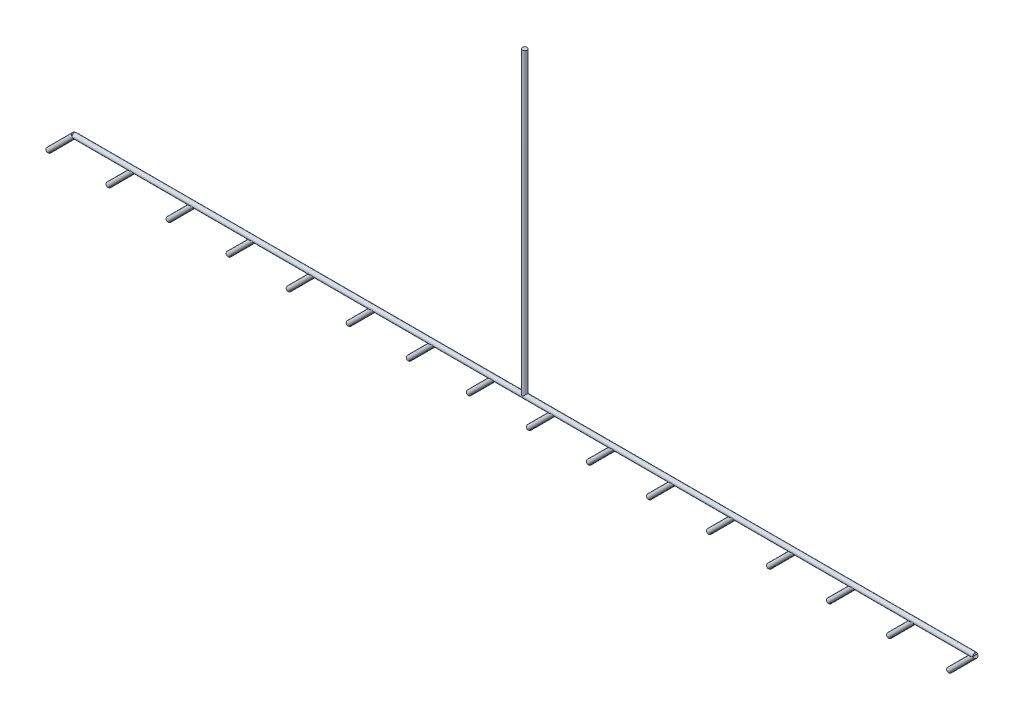
ISO-10303-21;
HEADER;
FILE_DESCRIPTION(('STEP AP214'),'2;1');
FILE_NAME('part.step','',(''),(''),'','','');
FILE_SCHEMA(('AUTOMOTIVE_DESIGN { 1 0 10303 214 1 1 1 1 }'));
ENDSEC;
DATA;
#1=APPLICATION_CONTEXT('core data for automotive mechanical design processes');
#2=APPLICATION_PROTOCOL_DEFINITION('international standard','automotive_design',2000,#1);
#3=PRODUCT_CONTEXT('',#1,'mechanical');
#4=PRODUCT('Part','Part','',(#3));
#5=PRODUCT_RELATED_PRODUCT_CATEGORY('part','',(#4));
#6=PRODUCT_DEFINITION_FORMATION('','',#4);
#7=PRODUCT_DEFINITION_CONTEXT('part definition',#1,'design');
#8=PRODUCT_DEFINITION('design','',#6,#7);
#9=PRODUCT_DEFINITION_SHAPE('','',#8);
#10=(LENGTH_UNIT() NAMED_UNIT(*) SI_UNIT(.MILLI.,.METRE.));
#11=(NAMED_UNIT(*) PLANE_ANGLE_UNIT() SI_UNIT($,.RADIAN.));
#12=(NAMED_UNIT(*) SI_UNIT($,.STERADIAN.) SOLID_ANGLE_UNIT());
#13=UNCERTAINTY_MEASURE_WITH_UNIT(LENGTH_MEASURE(1.E-05),#10,'distance_accuracy_value','');
#14=(GEOMETRIC_REPRESENTATION_CONTEXT(3) GLOBAL_UNCERTAINTY_ASSIGNED_CONTEXT((#13)) GLOBAL_UNIT_ASSIGNED_CONTEXT((#10,
#11,#12)) REPRESENTATION_CONTEXT('',''));
#15=CARTESIAN_POINT('',(0.,0.,0.));
#16=DIRECTION('',(0.,0.,1.));
#17=DIRECTION('',(1.,0.,0.));
#18=AXIS2_PLACEMENT_3D('',#15,#16,#17);
#19=CARTESIAN_POINT('',(1500.,0.,0.));
#20=DIRECTION('',(1.,0.,0.));
#21=DIRECTION('',(0.,0.,-1.));
#22=AXIS2_PLACEMENT_3D('',#19,#20,#21);
#23=PLANE('',#22);
#24=CARTESIAN_POINT('',(1500.,0.,0.));
#25=DIRECTION('',(1.,0.,0.));
#26=DIRECTION('',(0.,0.,-1.));
#27=AXIS2_PLACEMENT_3D('',#24,#25,#26);
#28=CIRCLE('',#27,4.);
#29=CARTESIAN_POINT('',(1500.,0.,-4.));
#30=VERTEX_POINT('',#29);
#31=CARTESIAN_POINT('',(1500.,0.,4.));
#32=VERTEX_POINT('',#31);
#33=EDGE_CURVE('E212',#30,#32,#28,.T.);
#34=ORIENTED_EDGE('',*,*,#33,.T.);
#35=DIRECTION('',(0.,0.,-1.));
#36=VECTOR('',#35,1.);
#37=CARTESIAN_POINT('',(1500.,0.,0.));
#38=LINE('',#37,#36);
#39=EDGE_CURVE('E147',#32,#30,#38,.T.);
#40=ORIENTED_EDGE('',*,*,#39,.T.);
#41=EDGE_LOOP('',(#34,#40));
#42=FACE_BOUND('',#41,.T.);
#43=ADVANCED_FACE('F31',(#42),#23,.T.);
#44=CARTESIAN_POINT('',(0.,0.,0.));
#45=DIRECTION('',(1.,0.,0.));
#46=DIRECTION('',(0.,0.,-1.));
#47=AXIS2_PLACEMENT_3D('',#44,#45,#46);
#48=PLANE('',#47);
#49=DIRECTION('',(0.,0.,-1.));
#50=VECTOR('',#49,1.);
#51=CARTESIAN_POINT('',(0.,0.,0.));
#52=LINE('',#51,#50);
#53=CARTESIAN_POINT('',(0.,0.,4.));
#54=VERTEX_POINT('',#53);
#55=CARTESIAN_POINT('',(0.,0.,-4.));
#56=VERTEX_POINT('',#55);
#57=EDGE_CURVE('E228',#54,#56,#52,.T.);
#58=ORIENTED_EDGE('',*,*,#57,.F.);
#59=CARTESIAN_POINT('',(0.,0.,0.));
#60=DIRECTION('',(1.,0.,0.));
#61=DIRECTION('',(0.,0.,-1.));
#62=AXIS2_PLACEMENT_3D('',#59,#60,#61);
#63=CIRCLE('',#62,4.);
#64=EDGE_CURVE('E215',#56,#54,#63,.T.);
#65=ORIENTED_EDGE('',*,*,#64,.F.);
#66=EDGE_LOOP('',(#58,#65));
#67=FACE_BOUND('',#66,.T.);
#68=ADVANCED_FACE('F151',(#67),#48,.F.);
#69=CARTESIAN_POINT('',(1500.,0.,0.));
#70=DIRECTION('',(-1.,0.,0.));
#71=DIRECTION('',(0.,0.,1.));
#72=AXIS2_PLACEMENT_3D('',#69,#70,#71);
#73=CYLINDRICAL_SURFACE('',#72,4.);
#74=CARTESIAN_POINT('',(750.,0.,0.));
#75=DIRECTION('',(-0.707106781186547,-0.707106781186547,0.));
#76=DIRECTION('',(-0.707106781186547,0.707106781186547,0.));
#77=AXIS2_PLACEMENT_3D('',#74,#75,#76);
#78=ELLIPSE('',#77,5.65685424949238,4.);
#79=CARTESIAN_POINT('',(750.,0.,4.));
#80=VERTEX_POINT('',#79);
#81=CARTESIAN_POINT('',(750.,0.,-4.));
#82=VERTEX_POINT('',#81);
#83=EDGE_CURVE('E39',#80,#82,#78,.T.);
#84=ORIENTED_EDGE('',*,*,#83,.T.);
#85=CARTESIAN_POINT('',(750.,0.,0.));
#86=DIRECTION('',(-0.707106781186547,0.707106781186547,0.));
#87=DIRECTION('',(-0.707106781186547,-0.707106781186547,0.));
#88=AXIS2_PLACEMENT_3D('',#85,#86,#87);
#89=ELLIPSE('',#88,5.65685424949238,4.);
#90=EDGE_CURVE('E11',#82,#80,#89,.F.);
#91=ORIENTED_EDGE('',*,*,#90,.T.);
#92=EDGE_LOOP('',(#84,#91));
#93=FACE_BOUND('',#92,.T.);
#94=CARTESIAN_POINT('',(1400.,0.,0.));
#95=DIRECTION('',(-0.38268343236509,0.923879532511287,0.));
#96=DIRECTION('',(-0.923879532511287,-0.38268343236509,0.));
#97=AXIS2_PLACEMENT_3D('',#94,#95,#96);
#98=ELLIPSE('',#97,10.452503719011,4.);
#99=CARTESIAN_POINT('',(1400.,0.,-4.));
#100=VERTEX_POINT('',#99);
#101=CARTESIAN_POINT('',(1400.,0.,4.));
#102=VERTEX_POINT('',#101);
#103=EDGE_CURVE('E155',#100,#102,#98,.T.);
#104=ORIENTED_EDGE('',*,*,#103,.T.);
#105=CARTESIAN_POINT('',(1400.,0.,0.));
#106=DIRECTION('',(-0.923879532511287,-0.38268343236509,0.));
#107=DIRECTION('',(-0.38268343236509,0.923879532511287,0.));
#108=AXIS2_PLACEMENT_3D('',#105,#106,#107);
#109=ELLIPSE('',#108,4.32956880116958,4.);
#110=EDGE_CURVE('E279',#102,#100,#109,.F.);
#111=ORIENTED_EDGE('',*,*,#110,.T.);
#112=EDGE_LOOP('',(#104,#111));
#113=FACE_BOUND('',#112,.T.);
#114=CARTESIAN_POINT('',(1300.,0.,0.));
#115=DIRECTION('',(-0.38268343236509,0.923879532511287,0.));
#116=DIRECTION('',(-0.923879532511287,-0.38268343236509,0.));
#117=AXIS2_PLACEMENT_3D('',#114,#115,#116);
#118=ELLIPSE('',#117,10.452503719011,4.);
#119=CARTESIAN_POINT('',(1300.,0.,-4.));
#120=VERTEX_POINT('',#119);
#121=CARTESIAN_POINT('',(1300.,0.,4.));
#122=VERTEX_POINT('',#121);
#123=EDGE_CURVE('E159',#120,#122,#118,.T.);
#124=ORIENTED_EDGE('',*,*,#123,.T.);
#125=CARTESIAN_POINT('',(1300.,0.,0.));
#126=DIRECTION('',(-0.923879532511287,-0.38268343236509,0.));
#127=DIRECTION('',(-0.38268343236509,0.923879532511287,0.));
#128=AXIS2_PLACEMENT_3D('',#125,#126,#127);
#129=ELLIPSE('',#128,4.32956880116958,4.);
#130=EDGE_CURVE('E276',#122,#120,#129,.F.);
#131=ORIENTED_EDGE('',*,*,#130,.T.);
#132=EDGE_LOOP('',(#124,#131));
#133=FACE_BOUND('',#132,.T.);
#134=CARTESIAN_POINT('',(1200.,0.,0.));
#135=DIRECTION('',(-0.38268343236509,0.923879532511287,0.));
#136=DIRECTION('',(-0.923879532511287,-0.38268343236509,0.));
#137=AXIS2_PLACEMENT_3D('',#134,#135,#136);
#138=ELLIPSE('',#137,10.452503719011,4.);
#139=CARTESIAN_POINT('',(1200.,0.,-4.));
#140=VERTEX_POINT('',#139);
#141=CARTESIAN_POINT('',(1200.,0.,4.));
#142=VERTEX_POINT('',#141);
#143=EDGE_CURVE('E163',#140,#142,#138,.T.);
#144=ORIENTED_EDGE('',*,*,#143,.T.);
#145=CARTESIAN_POINT('',(1200.,0.,0.));
#146=DIRECTION('',(-0.923879532511287,-0.38268343236509,0.));
#147=DIRECTION('',(-0.38268343236509,0.923879532511287,0.));
#148=AXIS2_PLACEMENT_3D('',#145,#146,#147);
#149=ELLIPSE('',#148,4.32956880116958,4.);
#150=EDGE_CURVE('E273',#142,#140,#149,.F.);
#151=ORIENTED_EDGE('',*,*,#150,.T.);
#152=EDGE_LOOP('',(#144,#151));
#153=FACE_BOUND('',#152,.T.);
#154=CARTESIAN_POINT('',(1100.,0.,0.));
#155=DIRECTION('',(-0.38268343236509,0.923879532511287,0.));
#156=DIRECTION('',(-0.923879532511287,-0.38268343236509,0.));
#157=AXIS2_PLACEMENT_3D('',#154,#155,#156);
#158=ELLIPSE('',#157,10.452503719011,4.);
#159=CARTESIAN_POINT('',(1100.,0.,-4.));
#160=VERTEX_POINT('',#159);
#161=CARTESIAN_POINT('',(1100.,0.,4.));
#162=VERTEX_POINT('',#161);
#163=EDGE_CURVE('E167',#160,#162,#158,.T.);
#164=ORIENTED_EDGE('',*,*,#163,.T.);
#165=CARTESIAN_POINT('',(1100.,0.,0.));
#166=DIRECTION('',(-0.923879532511287,-0.38268343236509,0.));
#167=DIRECTION('',(-0.38268343236509,0.923879532511287,0.));
#168=AXIS2_PLACEMENT_3D('',#165,#166,#167);
#169=ELLIPSE('',#168,4.32956880116958,4.);
#170=EDGE_CURVE('E270',#162,#160,#169,.F.);
#171=ORIENTED_EDGE('',*,*,#170,.T.);
#172=EDGE_LOOP('',(#164,#171));
#173=FACE_BOUND('',#172,.T.);
#174=CARTESIAN_POINT('',(1000.,0.,0.));
#175=DIRECTION('',(-0.38268343236509,0.923879532511287,0.));
#176=DIRECTION('',(-0.923879532511287,-0.38268343236509,0.));
#177=AXIS2_PLACEMENT_3D('',#174,#175,#176);
#178=ELLIPSE('',#177,10.452503719011,4.);
#179=CARTESIAN_POINT('',(1000.,0.,-4.));
#180=VERTEX_POINT('',#179);
#181=CARTESIAN_POINT('',(1000.,0.,4.));
#182=VERTEX_POINT('',#181);
#183=EDGE_CURVE('E171',#180,#182,#178,.T.);
#184=ORIENTED_EDGE('',*,*,#183,.T.);
#185=CARTESIAN_POINT('',(1000.,0.,0.));
#186=DIRECTION('',(-0.923879532511287,-0.38268343236509,0.));
#187=DIRECTION('',(-0.38268343236509,0.923879532511287,0.));
#188=AXIS2_PLACEMENT_3D('',#185,#186,#187);
#189=ELLIPSE('',#188,4.32956880116958,4.);
#190=EDGE_CURVE('E267',#182,#180,#189,.F.);
#191=ORIENTED_EDGE('',*,*,#190,.T.);
#192=EDGE_LOOP('',(#184,#191));
#193=FACE_BOUND('',#192,.T.);
#194=CARTESIAN_POINT('',(900.,0.,0.));
#195=DIRECTION('',(-0.38268343236509,0.923879532511287,0.));
#196=DIRECTION('',(-0.923879532511287,-0.38268343236509,0.));
#197=AXIS2_PLACEMENT_3D('',#194,#195,#196);
#198=ELLIPSE('',#197,10.452503719011,4.);
#199=CARTESIAN_POINT('',(900.,0.,-4.));
#200=VERTEX_POINT('',#199);
#201=CARTESIAN_POINT('',(900.,0.,4.));
#202=VERTEX_POINT('',#201);
#203=EDGE_CURVE('E175',#200,#202,#198,.T.);
#204=ORIENTED_EDGE('',*,*,#203,.T.);
#205=CARTESIAN_POINT('',(900.,0.,0.));
#206=DIRECTION('',(-0.923879532511287,-0.38268343236509,0.));
#207=DIRECTION('',(-0.38268343236509,0.923879532511287,0.));
#208=AXIS2_PLACEMENT_3D('',#205,#206,#207);
#209=ELLIPSE('',#208,4.32956880116958,4.);
#210=EDGE_CURVE('E264',#202,#200,#209,.F.);
#211=ORIENTED_EDGE('',*,*,#210,.T.);
#212=EDGE_LOOP('',(#204,#211));
#213=FACE_BOUND('',#212,.T.);
#214=CARTESIAN_POINT('',(800.,0.,0.));
#215=DIRECTION('',(-0.38268343236509,0.923879532511287,0.));
#216=DIRECTION('',(-0.923879532511287,-0.38268343236509,0.));
#217=AXIS2_PLACEMENT_3D('',#214,#215,#216);
#218=ELLIPSE('',#217,10.452503719011,4.);
#219=CARTESIAN_POINT('',(800.,0.,-4.));
#220=VERTEX_POINT('',#219);
#221=CARTESIAN_POINT('',(800.,0.,4.));
#222=VERTEX_POINT('',#221);
#223=EDGE_CURVE('E179',#220,#222,#218,.T.);
#224=ORIENTED_EDGE('',*,*,#223,.T.);
#225=CARTESIAN_POINT('',(800.,0.,0.));
#226=DIRECTION('',(-0.923879532511287,-0.38268343236509,0.));
#227=DIRECTION('',(-0.38268343236509,0.923879532511287,0.));
#228=AXIS2_PLACEMENT_3D('',#225,#226,#227);
#229=ELLIPSE('',#228,4.32956880116958,4.);
#230=EDGE_CURVE('E261',#222,#220,#229,.F.);
#231=ORIENTED_EDGE('',*,*,#230,.T.);
#232=EDGE_LOOP('',(#224,#231));
#233=FACE_BOUND('',#232,.T.);
#234=CARTESIAN_POINT('',(700.,0.,0.));
#235=DIRECTION('',(-0.38268343236509,0.923879532511287,0.));
#236=DIRECTION('',(-0.923879532511287,-0.38268343236509,0.));
#237=AXIS2_PLACEMENT_3D('',#234,#235,#236);
#238=ELLIPSE('',#237,10.452503719011,4.);
#239=CARTESIAN_POINT('',(700.,0.,-4.));
#240=VERTEX_POINT('',#239);
#241=CARTESIAN_POINT('',(700.,0.,4.));
#242=VERTEX_POINT('',#241);
#243=EDGE_CURVE('E183',#240,#242,#238,.T.);
#244=ORIENTED_EDGE('',*,*,#243,.T.);
#245=CARTESIAN_POINT('',(700.,0.,0.));
#246=DIRECTION('',(-0.923879532511287,-0.38268343236509,0.));
#247=DIRECTION('',(-0.38268343236509,0.923879532511287,0.));
#248=AXIS2_PLACEMENT_3D('',#245,#246,#247);
#249=ELLIPSE('',#248,4.32956880116958,4.);
#250=EDGE_CURVE('E258',#242,#240,#249,.F.);
#251=ORIENTED_EDGE('',*,*,#250,.T.);
#252=EDGE_LOOP('',(#244,#251));
#253=FACE_BOUND('',#252,.T.);
#254=CARTESIAN_POINT('',(600.,0.,0.));
#255=DIRECTION('',(-0.38268343236509,0.923879532511287,0.));
#256=DIRECTION('',(-0.923879532511287,-0.38268343236509,0.));
#257=AXIS2_PLACEMENT_3D('',#254,#255,#256);
#258=ELLIPSE('',#257,10.452503719011,4.);
#259=CARTESIAN_POINT('',(600.,0.,-4.));
#260=VERTEX_POINT('',#259);
#261=CARTESIAN_POINT('',(600.,0.,4.));
#262=VERTEX_POINT('',#261);
#263=EDGE_CURVE('E187',#260,#262,#258,.T.);
#264=ORIENTED_EDGE('',*,*,#263,.T.);
#265=CARTESIAN_POINT('',(600.,0.,0.));
#266=DIRECTION('',(-0.923879532511287,-0.38268343236509,0.));
#267=DIRECTION('',(-0.38268343236509,0.923879532511287,0.));
#268=AXIS2_PLACEMENT_3D('',#265,#266,#267);
#269=ELLIPSE('',#268,4.32956880116958,4.);
#270=EDGE_CURVE('E255',#262,#260,#269,.F.);
#271=ORIENTED_EDGE('',*,*,#270,.T.);
#272=EDGE_LOOP('',(#264,#271));
#273=FACE_BOUND('',#272,.T.);
#274=CARTESIAN_POINT('',(500.,0.,0.));
#275=DIRECTION('',(-0.38268343236509,0.923879532511287,0.));
#276=DIRECTION('',(-0.923879532511287,-0.38268343236509,0.));
#277=AXIS2_PLACEMENT_3D('',#274,#275,#276);
#278=ELLIPSE('',#277,10.452503719011,4.);
#279=CARTESIAN_POINT('',(500.,0.,-4.));
#280=VERTEX_POINT('',#279);
#281=CARTESIAN_POINT('',(500.,0.,4.));
#282=VERTEX_POINT('',#281);
#283=EDGE_CURVE('E191',#280,#282,#278,.T.);
#284=ORIENTED_EDGE('',*,*,#283,.T.);
#285=CARTESIAN_POINT('',(500.,0.,0.));
#286=DIRECTION('',(-0.923879532511287,-0.38268343236509,0.));
#287=DIRECTION('',(-0.38268343236509,0.923879532511287,0.));
#288=AXIS2_PLACEMENT_3D('',#285,#286,#287);
#289=ELLIPSE('',#288,4.32956880116958,4.);
#290=EDGE_CURVE('E252',#282,#280,#289,.F.);
#291=ORIENTED_EDGE('',*,*,#290,.T.);
#292=EDGE_LOOP('',(#284,#291));
#293=FACE_BOUND('',#292,.T.);
#294=CARTESIAN_POINT('',(400.,0.,0.));
#295=DIRECTION('',(-0.38268343236509,0.923879532511287,0.));
#296=DIRECTION('',(-0.923879532511287,-0.38268343236509,0.));
#297=AXIS2_PLACEMENT_3D('',#294,#295,#296);
#298=ELLIPSE('',#297,10.452503719011,4.);
#299=CARTESIAN_POINT('',(400.,0.,-4.));
#300=VERTEX_POINT('',#299);
#301=CARTESIAN_POINT('',(400.,0.,4.));
#302=VERTEX_POINT('',#301);
#303=EDGE_CURVE('E195',#300,#302,#298,.T.);
#304=ORIENTED_EDGE('',*,*,#303,.T.);
#305=CARTESIAN_POINT('',(400.,0.,0.));
#306=DIRECTION('',(-0.923879532511287,-0.38268343236509,0.));
#307=DIRECTION('',(-0.38268343236509,0.923879532511287,0.));
#308=AXIS2_PLACEMENT_3D('',#305,#306,#307);
#309=ELLIPSE('',#308,4.32956880116958,4.);
#310=EDGE_CURVE('E249',#302,#300,#309,.F.);
#311=ORIENTED_EDGE('',*,*,#310,.T.);
#312=EDGE_LOOP('',(#304,#311));
#313=FACE_BOUND('',#312,.T.);
#314=CARTESIAN_POINT('',(300.,0.,0.));
#315=DIRECTION('',(-0.38268343236509,0.923879532511287,0.));
#316=DIRECTION('',(-0.923879532511287,-0.38268343236509,0.));
#317=AXIS2_PLACEMENT_3D('',#314,#315,#316);
#318=ELLIPSE('',#317,10.452503719011,4.);
#319=CARTESIAN_POINT('',(300.,0.,-4.));
#320=VERTEX_POINT('',#319);
#321=CARTESIAN_POINT('',(300.,0.,4.));
#322=VERTEX_POINT('',#321);
#323=EDGE_CURVE('E199',#320,#322,#318,.T.);
#324=ORIENTED_EDGE('',*,*,#323,.T.);
#325=CARTESIAN_POINT('',(300.,0.,0.));
#326=DIRECTION('',(-0.923879532511287,-0.38268343236509,0.));
#327=DIRECTION('',(-0.38268343236509,0.923879532511287,0.));
#328=AXIS2_PLACEMENT_3D('',#325,#326,#327);
#329=ELLIPSE('',#328,4.32956880116958,4.);
#330=EDGE_CURVE('E246',#322,#320,#329,.F.);
#331=ORIENTED_EDGE('',*,*,#330,.T.);
#332=EDGE_LOOP('',(#324,#331));
#333=FACE_BOUND('',#332,.T.);
#334=CARTESIAN_POINT('',(199.999999999999,-2.28983498828938E-13,0.));
#335=DIRECTION('',(-0.38268343236509,0.923879532511287,0.));
#336=DIRECTION('',(-0.923879532511287,-0.38268343236509,0.));
#337=AXIS2_PLACEMENT_3D('',#334,#335,#336);
#338=ELLIPSE('',#337,10.452503719011,4.);
#339=CARTESIAN_POINT('',(200.,0.,-4.));
#340=VERTEX_POINT('',#339);
#341=CARTESIAN_POINT('',(200.,0.,4.));
#342=VERTEX_POINT('',#341);
#343=EDGE_CURVE('E203',#340,#342,#338,.T.);
#344=ORIENTED_EDGE('',*,*,#343,.T.);
#345=CARTESIAN_POINT('',(199.999999999999,-2.28983498828938E-13,0.));
#346=DIRECTION('',(-0.923879532511287,-0.38268343236509,0.));
#347=DIRECTION('',(-0.38268343236509,0.923879532511287,0.));
#348=AXIS2_PLACEMENT_3D('',#345,#346,#347);
#349=ELLIPSE('',#348,4.32956880116958,4.);
#350=EDGE_CURVE('E243',#342,#340,#349,.F.);
#351=ORIENTED_EDGE('',*,*,#350,.T.);
#352=EDGE_LOOP('',(#344,#351));
#353=FACE_BOUND('',#352,.T.);
#354=CARTESIAN_POINT('',(99.9999999999997,0.,0.));
#355=DIRECTION('',(-0.38268343236509,0.923879532511287,0.));
#356=DIRECTION('',(-0.923879532511287,-0.38268343236509,0.));
#357=AXIS2_PLACEMENT_3D('',#354,#355,#356);
#358=ELLIPSE('',#357,10.452503719011,4.);
#359=CARTESIAN_POINT('',(99.9999999999999,0.,-4.));
#360=VERTEX_POINT('',#359);
#361=CARTESIAN_POINT('',(100.,0.,4.));
#362=VERTEX_POINT('',#361);
#363=EDGE_CURVE('E207',#360,#362,#358,.T.);
#364=ORIENTED_EDGE('',*,*,#363,.T.);
#365=CARTESIAN_POINT('',(99.9999999999997,0.,0.));
#366=DIRECTION('',(-0.923879532511287,-0.38268343236509,0.));
#367=DIRECTION('',(-0.38268343236509,0.923879532511287,0.));
#368=AXIS2_PLACEMENT_3D('',#365,#366,#367);
#369=ELLIPSE('',#368,4.32956880116958,4.);
#370=EDGE_CURVE('E240',#362,#360,#369,.F.);
#371=ORIENTED_EDGE('',*,*,#370,.T.);
#372=EDGE_LOOP('',(#364,#371));
#373=FACE_BOUND('',#372,.T.);
#374=ORIENTED_EDGE('',*,*,#33,.F.);
#375=CARTESIAN_POINT('',(1500.,0.,0.));
#376=DIRECTION('',(-0.38268343236509,0.923879532511287,0.));
#377=DIRECTION('',(-0.923879532511287,-0.38268343236509,0.));
#378=AXIS2_PLACEMENT_3D('',#375,#376,#377);
#379=ELLIPSE('',#378,10.452503719011,4.);
#380=EDGE_CURVE('E286',#30,#32,#379,.T.);
#381=ORIENTED_EDGE('',*,*,#380,.T.);
#382=EDGE_LOOP('',(#374,#381));
#383=FACE_BOUND('',#382,.T.);
#384=ORIENTED_EDGE('',*,*,#64,.T.);
#385=CARTESIAN_POINT('',(-5.03069808033274E-13,-1.6306400674182E-13,0.));
#386=DIRECTION('',(-0.923879532511287,-0.38268343236509,0.));
#387=DIRECTION('',(-0.38268343236509,0.923879532511287,0.));
#388=AXIS2_PLACEMENT_3D('',#385,#386,#387);
#389=ELLIPSE('',#388,4.32956880116958,4.);
#390=EDGE_CURVE('E217',#54,#56,#389,.F.);
#391=ORIENTED_EDGE('',*,*,#390,.T.);
#392=EDGE_LOOP('',(#384,#391));
#393=FACE_BOUND('',#392,.T.);
#394=ADVANCED_FACE('F33',(#93,#113,#133,#153,#173,#193,#213,#233,#253,#273,#293,#313,#333,#353,
#373,#383,#393),#73,.T.);
#395=CARTESIAN_POINT('',(0.,0.,0.));
#396=DIRECTION('',(-0.707106781186547,-0.707106781186547,0.));
#397=DIRECTION('',(0.707106781186548,-0.707106781186548,0.));
#398=AXIS2_PLACEMENT_3D('',#395,#396,#397);
#399=CYLINDRICAL_SURFACE('',#398,4.);
#400=CARTESIAN_POINT('',(-42.4264068711929,-42.4264068711928,0.));
#401=DIRECTION('',(-0.707106781186548,-0.707106781186547,0.));
#402=DIRECTION('',(0.707106781186547,-0.707106781186548,0.));
#403=AXIS2_PLACEMENT_3D('',#400,#401,#402);
#404=CIRCLE('',#403,4.);
#405=CARTESIAN_POINT('',(-39.5979797464467,-45.254833995939,0.));
#406=VERTEX_POINT('',#405);
#407=EDGE_CURVE('E229',#406,#406,#404,.T.);
#408=ORIENTED_EDGE('',*,*,#407,.F.);
#409=EDGE_LOOP('',(#408));
#410=FACE_BOUND('',#409,.T.);
#411=ORIENTED_EDGE('',*,*,#390,.F.);
#412=CARTESIAN_POINT('',(0.,0.,0.));
#413=DIRECTION('',(-0.707106781186548,-0.707106781186547,0.));
#414=DIRECTION('',(0.707106781186547,-0.707106781186548,0.));
#415=AXIS2_PLACEMENT_3D('',#412,#413,#414);
#416=CIRCLE('',#415,4.);
#417=EDGE_CURVE('E224',#54,#56,#416,.T.);
#418=ORIENTED_EDGE('',*,*,#417,.T.);
#419=EDGE_LOOP('',(#411,#418));
#420=FACE_BOUND('',#419,.T.);
#421=ADVANCED_FACE('F150',(#410,#420),#399,.T.);
#422=CARTESIAN_POINT('',(0.,0.,0.));
#423=DIRECTION('',(-0.707106781186548,-0.707106781186547,0.));
#424=DIRECTION('',(0.707106781186547,-0.707106781186548,0.));
#425=AXIS2_PLACEMENT_3D('',#422,#423,#424);
#426=PLANE('',#425);
#427=ORIENTED_EDGE('',*,*,#417,.F.);
#428=ORIENTED_EDGE('',*,*,#57,.T.);
#429=EDGE_LOOP('',(#427,#428));
#430=FACE_BOUND('',#429,.T.);
#431=ADVANCED_FACE('F227',(#430),#426,.F.);
#432=CARTESIAN_POINT('',(-42.4264068711929,-42.4264068711928,0.));
#433=DIRECTION('',(-0.707106781186548,-0.707106781186547,0.));
#434=DIRECTION('',(0.707106781186547,-0.707106781186548,0.));
#435=AXIS2_PLACEMENT_3D('',#432,#433,#434);
#436=PLANE('',#435);
#437=ORIENTED_EDGE('',*,*,#407,.T.);
#438=EDGE_LOOP('',(#437));
#439=FACE_BOUND('',#438,.T.);
#440=ADVANCED_FACE('F339',(#439),#436,.T.);
#441=CARTESIAN_POINT('',(100.,0.,0.));
#442=DIRECTION('',(-0.707106781186547,-0.707106781186547,0.));
#443=DIRECTION('',(0.707106781186548,-0.707106781186548,0.));
#444=AXIS2_PLACEMENT_3D('',#441,#442,#443);
#445=CYLINDRICAL_SURFACE('',#444,4.);
#446=CARTESIAN_POINT('',(57.5735931288071,-42.4264068711928,0.));
#447=DIRECTION('',(-0.707106781186548,-0.707106781186547,0.));
#448=DIRECTION('',(0.707106781186547,-0.707106781186548,0.));
#449=AXIS2_PLACEMENT_3D('',#446,#447,#448);
#450=CIRCLE('',#449,4.);
#451=CARTESIAN_POINT('',(60.4020202535533,-45.254833995939,0.));
#452=VERTEX_POINT('',#451);
#453=EDGE_CURVE('E232',#452,#452,#450,.T.);
#454=ORIENTED_EDGE('',*,*,#453,.F.);
#455=EDGE_LOOP('',(#454));
#456=FACE_BOUND('',#455,.T.);
#457=ORIENTED_EDGE('',*,*,#370,.F.);
#458=ORIENTED_EDGE('',*,*,#363,.F.);
#459=EDGE_LOOP('',(#457,#458));
#460=FACE_BOUND('',#459,.T.);
#461=ADVANCED_FACE('F336',(#456,#460),#445,.T.);
#462=CARTESIAN_POINT('',(57.5735931288071,-42.4264068711928,0.));
#463=DIRECTION('',(-0.707106781186548,-0.707106781186547,0.));
#464=DIRECTION('',(0.707106781186547,-0.707106781186548,0.));
#465=AXIS2_PLACEMENT_3D('',#462,#463,#464);
#466=PLANE('',#465);
#467=ORIENTED_EDGE('',*,*,#453,.T.);
#468=EDGE_LOOP('',(#467));
#469=FACE_BOUND('',#468,.T.);
#470=ADVANCED_FACE('F334',(#469),#466,.T.);
#471=CARTESIAN_POINT('',(200.,0.,0.));
#472=DIRECTION('',(-0.707106781186547,-0.707106781186547,0.));
#473=DIRECTION('',(0.707106781186548,-0.707106781186547,0.));
#474=AXIS2_PLACEMENT_3D('',#471,#472,#473);
#475=CYLINDRICAL_SURFACE('',#474,4.);
#476=CARTESIAN_POINT('',(157.573593128807,-42.4264068711928,0.));
#477=DIRECTION('',(-0.707106781186548,-0.707106781186547,0.));
#478=DIRECTION('',(0.707106781186547,-0.707106781186548,0.));
#479=AXIS2_PLACEMENT_3D('',#476,#477,#478);
#480=CIRCLE('',#479,4.);
#481=CARTESIAN_POINT('',(160.402020253553,-45.254833995939,0.));
#482=VERTEX_POINT('',#481);
#483=EDGE_CURVE('E327',#482,#482,#480,.T.);
#484=ORIENTED_EDGE('',*,*,#483,.F.);
#485=EDGE_LOOP('',(#484));
#486=FACE_BOUND('',#485,.T.);
#487=ORIENTED_EDGE('',*,*,#350,.F.);
#488=ORIENTED_EDGE('',*,*,#343,.F.);
#489=EDGE_LOOP('',(#487,#488));
#490=FACE_BOUND('',#489,.T.);
#491=ADVANCED_FACE('F345',(#486,#490),#475,.T.);
#492=CARTESIAN_POINT('',(157.573593128807,-42.4264068711928,0.));
#493=DIRECTION('',(-0.707106781186548,-0.707106781186547,0.));
#494=DIRECTION('',(0.707106781186547,-0.707106781186548,0.));
#495=AXIS2_PLACEMENT_3D('',#492,#493,#494);
#496=PLANE('',#495);
#497=ORIENTED_EDGE('',*,*,#483,.T.);
#498=EDGE_LOOP('',(#497));
#499=FACE_BOUND('',#498,.T.);
#500=ADVANCED_FACE('F390',(#499),#496,.T.);
#501=CARTESIAN_POINT('',(300.,0.,0.));
#502=DIRECTION('',(-0.707106781186548,-0.707106781186547,0.));
#503=DIRECTION('',(0.707106781186547,-0.707106781186548,0.));
#504=AXIS2_PLACEMENT_3D('',#501,#502,#503);
#505=CYLINDRICAL_SURFACE('',#504,4.);
#506=CARTESIAN_POINT('',(257.573593128807,-42.4264068711928,0.));
#507=DIRECTION('',(-0.707106781186548,-0.707106781186547,0.));
#508=DIRECTION('',(0.707106781186547,-0.707106781186548,0.));
#509=AXIS2_PLACEMENT_3D('',#506,#507,#508);
#510=CIRCLE('',#509,4.);
#511=CARTESIAN_POINT('',(260.402020253553,-45.254833995939,0.));
#512=VERTEX_POINT('',#511);
#513=EDGE_CURVE('E325',#512,#512,#510,.T.);
#514=ORIENTED_EDGE('',*,*,#513,.F.);
#515=EDGE_LOOP('',(#514));
#516=FACE_BOUND('',#515,.T.);
#517=ORIENTED_EDGE('',*,*,#330,.F.);
#518=ORIENTED_EDGE('',*,*,#323,.F.);
#519=EDGE_LOOP('',(#517,#518));
#520=FACE_BOUND('',#519,.T.);
#521=ADVANCED_FACE('F400',(#516,#520),#505,.T.);
#522=CARTESIAN_POINT('',(257.573593128807,-42.4264068711928,0.));
#523=DIRECTION('',(-0.707106781186548,-0.707106781186547,0.));
#524=DIRECTION('',(0.707106781186547,-0.707106781186548,0.));
#525=AXIS2_PLACEMENT_3D('',#522,#523,#524);
#526=PLANE('',#525);
#527=ORIENTED_EDGE('',*,*,#513,.T.);
#528=EDGE_LOOP('',(#527));
#529=FACE_BOUND('',#528,.T.);
#530=ADVANCED_FACE('F409',(#529),#526,.T.);
#531=CARTESIAN_POINT('',(400.,0.,0.));
#532=DIRECTION('',(-0.707106781186548,-0.707106781186547,0.));
#533=DIRECTION('',(0.707106781186547,-0.707106781186548,0.));
#534=AXIS2_PLACEMENT_3D('',#531,#532,#533);
#535=CYLINDRICAL_SURFACE('',#534,4.);
#536=CARTESIAN_POINT('',(357.573593128807,-42.4264068711928,0.));
#537=DIRECTION('',(-0.707106781186548,-0.707106781186547,0.));
#538=DIRECTION('',(0.707106781186547,-0.707106781186548,0.));
#539=AXIS2_PLACEMENT_3D('',#536,#537,#538);
#540=CIRCLE('',#539,4.);
#541=CARTESIAN_POINT('',(360.402020253553,-45.254833995939,0.));
#542=VERTEX_POINT('',#541);
#543=EDGE_CURVE('E322',#542,#542,#540,.T.);
#544=ORIENTED_EDGE('',*,*,#543,.F.);
#545=EDGE_LOOP('',(#544));
#546=FACE_BOUND('',#545,.T.);
#547=ORIENTED_EDGE('',*,*,#310,.F.);
#548=ORIENTED_EDGE('',*,*,#303,.F.);
#549=EDGE_LOOP('',(#547,#548));
#550=FACE_BOUND('',#549,.T.);
#551=ADVANCED_FACE('F419',(#546,#550),#535,.T.);
#552=CARTESIAN_POINT('',(357.573593128807,-42.4264068711928,0.));
#553=DIRECTION('',(-0.707106781186548,-0.707106781186547,0.));
#554=DIRECTION('',(0.707106781186547,-0.707106781186548,0.));
#555=AXIS2_PLACEMENT_3D('',#552,#553,#554);
#556=PLANE('',#555);
#557=ORIENTED_EDGE('',*,*,#543,.T.);
#558=EDGE_LOOP('',(#557));
#559=FACE_BOUND('',#558,.T.);
#560=ADVANCED_FACE('F429',(#559),#556,.T.);
#561=CARTESIAN_POINT('',(500.,0.,0.));
#562=DIRECTION('',(-0.707106781186548,-0.707106781186547,0.));
#563=DIRECTION('',(0.707106781186547,-0.707106781186548,0.));
#564=AXIS2_PLACEMENT_3D('',#561,#562,#563);
#565=CYLINDRICAL_SURFACE('',#564,4.);
#566=CARTESIAN_POINT('',(457.573593128807,-42.4264068711928,0.));
#567=DIRECTION('',(-0.707106781186548,-0.707106781186547,0.));
#568=DIRECTION('',(0.707106781186547,-0.707106781186548,0.));
#569=AXIS2_PLACEMENT_3D('',#566,#567,#568);
#570=CIRCLE('',#569,4.);
#571=CARTESIAN_POINT('',(460.402020253553,-45.254833995939,0.));
#572=VERTEX_POINT('',#571);
#573=EDGE_CURVE('E319',#572,#572,#570,.T.);
#574=ORIENTED_EDGE('',*,*,#573,.F.);
#575=EDGE_LOOP('',(#574));
#576=FACE_BOUND('',#575,.T.);
#577=ORIENTED_EDGE('',*,*,#290,.F.);
#578=ORIENTED_EDGE('',*,*,#283,.F.);
#579=EDGE_LOOP('',(#577,#578));
#580=FACE_BOUND('',#579,.T.);
#581=ADVANCED_FACE('F439',(#576,#580),#565,.T.);
#582=CARTESIAN_POINT('',(457.573593128807,-42.4264068711928,0.));
#583=DIRECTION('',(-0.707106781186548,-0.707106781186547,0.));
#584=DIRECTION('',(0.707106781186547,-0.707106781186548,0.));
#585=AXIS2_PLACEMENT_3D('',#582,#583,#584);
#586=PLANE('',#585);
#587=ORIENTED_EDGE('',*,*,#573,.T.);
#588=EDGE_LOOP('',(#587));
#589=FACE_BOUND('',#588,.T.);
#590=ADVANCED_FACE('F449',(#589),#586,.T.);
#591=CARTESIAN_POINT('',(600.,0.,0.));
#592=DIRECTION('',(-0.707106781186547,-0.707106781186548,0.));
#593=DIRECTION('',(0.707106781186548,-0.707106781186547,0.));
#594=AXIS2_PLACEMENT_3D('',#591,#592,#593);
#595=CYLINDRICAL_SURFACE('',#594,4.);
#596=CARTESIAN_POINT('',(557.573593128807,-42.4264068711928,0.));
#597=DIRECTION('',(-0.707106781186548,-0.707106781186547,0.));
#598=DIRECTION('',(0.707106781186547,-0.707106781186548,0.));
#599=AXIS2_PLACEMENT_3D('',#596,#597,#598);
#600=CIRCLE('',#599,4.);
#601=CARTESIAN_POINT('',(560.402020253553,-45.254833995939,0.));
#602=VERTEX_POINT('',#601);
#603=EDGE_CURVE('E316',#602,#602,#600,.T.);
#604=ORIENTED_EDGE('',*,*,#603,.F.);
#605=EDGE_LOOP('',(#604));
#606=FACE_BOUND('',#605,.T.);
#607=ORIENTED_EDGE('',*,*,#270,.F.);
#608=ORIENTED_EDGE('',*,*,#263,.F.);
#609=EDGE_LOOP('',(#607,#608));
#610=FACE_BOUND('',#609,.T.);
#611=ADVANCED_FACE('F459',(#606,#610),#595,.T.);
#612=CARTESIAN_POINT('',(557.573593128807,-42.4264068711928,0.));
#613=DIRECTION('',(-0.707106781186548,-0.707106781186547,0.));
#614=DIRECTION('',(0.707106781186547,-0.707106781186548,0.));
#615=AXIS2_PLACEMENT_3D('',#612,#613,#614);
#616=PLANE('',#615);
#617=ORIENTED_EDGE('',*,*,#603,.T.);
#618=EDGE_LOOP('',(#617));
#619=FACE_BOUND('',#618,.T.);
#620=ADVANCED_FACE('F469',(#619),#616,.T.);
#621=CARTESIAN_POINT('',(700.,0.,0.));
#622=DIRECTION('',(-0.707106781186547,-0.707106781186548,0.));
#623=DIRECTION('',(0.707106781186548,-0.707106781186547,0.));
#624=AXIS2_PLACEMENT_3D('',#621,#622,#623);
#625=CYLINDRICAL_SURFACE('',#624,4.);
#626=CARTESIAN_POINT('',(657.573593128807,-42.4264068711928,0.));
#627=DIRECTION('',(-0.707106781186548,-0.707106781186547,0.));
#628=DIRECTION('',(0.707106781186547,-0.707106781186548,0.));
#629=AXIS2_PLACEMENT_3D('',#626,#627,#628);
#630=CIRCLE('',#629,4.);
#631=CARTESIAN_POINT('',(660.402020253553,-45.254833995939,0.));
#632=VERTEX_POINT('',#631);
#633=EDGE_CURVE('E313',#632,#632,#630,.T.);
#634=ORIENTED_EDGE('',*,*,#633,.F.);
#635=EDGE_LOOP('',(#634));
#636=FACE_BOUND('',#635,.T.);
#637=ORIENTED_EDGE('',*,*,#250,.F.);
#638=ORIENTED_EDGE('',*,*,#243,.F.);
#639=EDGE_LOOP('',(#637,#638));
#640=FACE_BOUND('',#639,.T.);
#641=ADVANCED_FACE('F479',(#636,#640),#625,.T.);
#642=CARTESIAN_POINT('',(657.573593128807,-42.4264068711928,0.));
#643=DIRECTION('',(-0.707106781186548,-0.707106781186547,0.));
#644=DIRECTION('',(0.707106781186547,-0.707106781186548,0.));
#645=AXIS2_PLACEMENT_3D('',#642,#643,#644);
#646=PLANE('',#645);
#647=ORIENTED_EDGE('',*,*,#633,.T.);
#648=EDGE_LOOP('',(#647));
#649=FACE_BOUND('',#648,.T.);
#650=ADVANCED_FACE('F489',(#649),#646,.T.);
#651=CARTESIAN_POINT('',(800.,0.,0.));
#652=DIRECTION('',(-0.707106781186547,-0.707106781186548,0.));
#653=DIRECTION('',(0.707106781186548,-0.707106781186547,0.));
#654=AXIS2_PLACEMENT_3D('',#651,#652,#653);
#655=CYLINDRICAL_SURFACE('',#654,4.);
#656=CARTESIAN_POINT('',(757.573593128807,-42.4264068711928,0.));
#657=DIRECTION('',(-0.707106781186548,-0.707106781186547,0.));
#658=DIRECTION('',(0.707106781186547,-0.707106781186548,0.));
#659=AXIS2_PLACEMENT_3D('',#656,#657,#658);
#660=CIRCLE('',#659,4.);
#661=CARTESIAN_POINT('',(760.402020253553,-45.254833995939,0.));
#662=VERTEX_POINT('',#661);
#663=EDGE_CURVE('E310',#662,#662,#660,.T.);
#664=ORIENTED_EDGE('',*,*,#663,.F.);
#665=EDGE_LOOP('',(#664));
#666=FACE_BOUND('',#665,.T.);
#667=ORIENTED_EDGE('',*,*,#230,.F.);
#668=ORIENTED_EDGE('',*,*,#223,.F.);
#669=EDGE_LOOP('',(#667,#668));
#670=FACE_BOUND('',#669,.T.);
#671=ADVANCED_FACE('F499',(#666,#670),#655,.T.);
#672=CARTESIAN_POINT('',(757.573593128807,-42.4264068711928,0.));
#673=DIRECTION('',(-0.707106781186548,-0.707106781186547,0.));
#674=DIRECTION('',(0.707106781186547,-0.707106781186548,0.));
#675=AXIS2_PLACEMENT_3D('',#672,#673,#674);
#676=PLANE('',#675);
#677=ORIENTED_EDGE('',*,*,#663,.T.);
#678=EDGE_LOOP('',(#677));
#679=FACE_BOUND('',#678,.T.);
#680=ADVANCED_FACE('F509',(#679),#676,.T.);
#681=CARTESIAN_POINT('',(900.,0.,0.));
#682=DIRECTION('',(-0.707106781186547,-0.707106781186548,0.));
#683=DIRECTION('',(0.707106781186548,-0.707106781186547,0.));
#684=AXIS2_PLACEMENT_3D('',#681,#682,#683);
#685=CYLINDRICAL_SURFACE('',#684,4.);
#686=CARTESIAN_POINT('',(857.573593128807,-42.4264068711928,0.));
#687=DIRECTION('',(-0.707106781186548,-0.707106781186547,0.));
#688=DIRECTION('',(0.707106781186547,-0.707106781186548,0.));
#689=AXIS2_PLACEMENT_3D('',#686,#687,#688);
#690=CIRCLE('',#689,4.);
#691=CARTESIAN_POINT('',(860.402020253553,-45.254833995939,0.));
#692=VERTEX_POINT('',#691);
#693=EDGE_CURVE('E307',#692,#692,#690,.T.);
#694=ORIENTED_EDGE('',*,*,#693,.F.);
#695=EDGE_LOOP('',(#694));
#696=FACE_BOUND('',#695,.T.);
#697=ORIENTED_EDGE('',*,*,#210,.F.);
#698=ORIENTED_EDGE('',*,*,#203,.F.);
#699=EDGE_LOOP('',(#697,#698));
#700=FACE_BOUND('',#699,.T.);
#701=ADVANCED_FACE('F519',(#696,#700),#685,.T.);
#702=CARTESIAN_POINT('',(857.573593128807,-42.4264068711928,0.));
#703=DIRECTION('',(-0.707106781186548,-0.707106781186547,0.));
#704=DIRECTION('',(0.707106781186547,-0.707106781186548,0.));
#705=AXIS2_PLACEMENT_3D('',#702,#703,#704);
#706=PLANE('',#705);
#707=ORIENTED_EDGE('',*,*,#693,.T.);
#708=EDGE_LOOP('',(#707));
#709=FACE_BOUND('',#708,.T.);
#710=ADVANCED_FACE('F529',(#709),#706,.T.);
#711=CARTESIAN_POINT('',(1000.,0.,0.));
#712=DIRECTION('',(-0.707106781186547,-0.707106781186548,0.));
#713=DIRECTION('',(0.707106781186548,-0.707106781186547,0.));
#714=AXIS2_PLACEMENT_3D('',#711,#712,#713);
#715=CYLINDRICAL_SURFACE('',#714,4.);
#716=CARTESIAN_POINT('',(957.573593128807,-42.4264068711928,0.));
#717=DIRECTION('',(-0.707106781186548,-0.707106781186547,0.));
#718=DIRECTION('',(0.707106781186547,-0.707106781186548,0.));
#719=AXIS2_PLACEMENT_3D('',#716,#717,#718);
#720=CIRCLE('',#719,4.);
#721=CARTESIAN_POINT('',(960.402020253553,-45.254833995939,0.));
#722=VERTEX_POINT('',#721);
#723=EDGE_CURVE('E304',#722,#722,#720,.T.);
#724=ORIENTED_EDGE('',*,*,#723,.F.);
#725=EDGE_LOOP('',(#724));
#726=FACE_BOUND('',#725,.T.);
#727=ORIENTED_EDGE('',*,*,#190,.F.);
#728=ORIENTED_EDGE('',*,*,#183,.F.);
#729=EDGE_LOOP('',(#727,#728));
#730=FACE_BOUND('',#729,.T.);
#731=ADVANCED_FACE('F539',(#726,#730),#715,.T.);
#732=CARTESIAN_POINT('',(957.573593128807,-42.4264068711928,0.));
#733=DIRECTION('',(-0.707106781186548,-0.707106781186547,0.));
#734=DIRECTION('',(0.707106781186547,-0.707106781186548,0.));
#735=AXIS2_PLACEMENT_3D('',#732,#733,#734);
#736=PLANE('',#735);
#737=ORIENTED_EDGE('',*,*,#723,.T.);
#738=EDGE_LOOP('',(#737));
#739=FACE_BOUND('',#738,.T.);
#740=ADVANCED_FACE('F549',(#739),#736,.T.);
#741=CARTESIAN_POINT('',(1100.,0.,0.));
#742=DIRECTION('',(-0.707106781186547,-0.707106781186548,0.));
#743=DIRECTION('',(0.707106781186548,-0.707106781186547,0.));
#744=AXIS2_PLACEMENT_3D('',#741,#742,#743);
#745=CYLINDRICAL_SURFACE('',#744,4.);
#746=CARTESIAN_POINT('',(1057.57359312881,-42.4264068711928,0.));
#747=DIRECTION('',(-0.707106781186548,-0.707106781186547,0.));
#748=DIRECTION('',(0.707106781186547,-0.707106781186548,0.));
#749=AXIS2_PLACEMENT_3D('',#746,#747,#748);
#750=CIRCLE('',#749,4.);
#751=CARTESIAN_POINT('',(1060.40202025355,-45.254833995939,0.));
#752=VERTEX_POINT('',#751);
#753=EDGE_CURVE('E301',#752,#752,#750,.T.);
#754=ORIENTED_EDGE('',*,*,#753,.F.);
#755=EDGE_LOOP('',(#754));
#756=FACE_BOUND('',#755,.T.);
#757=ORIENTED_EDGE('',*,*,#170,.F.);
#758=ORIENTED_EDGE('',*,*,#163,.F.);
#759=EDGE_LOOP('',(#757,#758));
#760=FACE_BOUND('',#759,.T.);
#761=ADVANCED_FACE('F559',(#756,#760),#745,.T.);
#762=CARTESIAN_POINT('',(1057.57359312881,-42.4264068711928,0.));
#763=DIRECTION('',(-0.707106781186548,-0.707106781186547,0.));
#764=DIRECTION('',(0.707106781186547,-0.707106781186548,0.));
#765=AXIS2_PLACEMENT_3D('',#762,#763,#764);
#766=PLANE('',#765);
#767=ORIENTED_EDGE('',*,*,#753,.T.);
#768=EDGE_LOOP('',(#767));
#769=FACE_BOUND('',#768,.T.);
#770=ADVANCED_FACE('F569',(#769),#766,.T.);
#771=CARTESIAN_POINT('',(1200.,0.,0.));
#772=DIRECTION('',(-0.707106781186547,-0.707106781186548,0.));
#773=DIRECTION('',(0.707106781186548,-0.707106781186547,0.));
#774=AXIS2_PLACEMENT_3D('',#771,#772,#773);
#775=CYLINDRICAL_SURFACE('',#774,4.);
#776=CARTESIAN_POINT('',(1157.57359312881,-42.4264068711928,0.));
#777=DIRECTION('',(-0.707106781186548,-0.707106781186547,0.));
#778=DIRECTION('',(0.707106781186547,-0.707106781186548,0.));
#779=AXIS2_PLACEMENT_3D('',#776,#777,#778);
#780=CIRCLE('',#779,4.);
#781=CARTESIAN_POINT('',(1160.40202025355,-45.254833995939,0.));
#782=VERTEX_POINT('',#781);
#783=EDGE_CURVE('E298',#782,#782,#780,.T.);
#784=ORIENTED_EDGE('',*,*,#783,.F.);
#785=EDGE_LOOP('',(#784));
#786=FACE_BOUND('',#785,.T.);
#787=ORIENTED_EDGE('',*,*,#150,.F.);
#788=ORIENTED_EDGE('',*,*,#143,.F.);
#789=EDGE_LOOP('',(#787,#788));
#790=FACE_BOUND('',#789,.T.);
#791=ADVANCED_FACE('F579',(#786,#790),#775,.T.);
#792=CARTESIAN_POINT('',(1157.57359312881,-42.4264068711928,0.));
#793=DIRECTION('',(-0.707106781186548,-0.707106781186547,0.));
#794=DIRECTION('',(0.707106781186547,-0.707106781186548,0.));
#795=AXIS2_PLACEMENT_3D('',#792,#793,#794);
#796=PLANE('',#795);
#797=ORIENTED_EDGE('',*,*,#783,.T.);
#798=EDGE_LOOP('',(#797));
#799=FACE_BOUND('',#798,.T.);
#800=ADVANCED_FACE('F589',(#799),#796,.T.);
#801=CARTESIAN_POINT('',(1300.,0.,0.));
#802=DIRECTION('',(-0.707106781186547,-0.707106781186548,0.));
#803=DIRECTION('',(0.707106781186548,-0.707106781186547,0.));
#804=AXIS2_PLACEMENT_3D('',#801,#802,#803);
#805=CYLINDRICAL_SURFACE('',#804,4.);
#806=CARTESIAN_POINT('',(1257.57359312881,-42.4264068711928,0.));
#807=DIRECTION('',(-0.707106781186548,-0.707106781186547,0.));
#808=DIRECTION('',(0.707106781186547,-0.707106781186548,0.));
#809=AXIS2_PLACEMENT_3D('',#806,#807,#808);
#810=CIRCLE('',#809,4.);
#811=CARTESIAN_POINT('',(1260.40202025355,-45.254833995939,0.));
#812=VERTEX_POINT('',#811);
#813=EDGE_CURVE('E292',#812,#812,#810,.T.);
#814=ORIENTED_EDGE('',*,*,#813,.F.);
#815=EDGE_LOOP('',(#814));
#816=FACE_BOUND('',#815,.T.);
#817=ORIENTED_EDGE('',*,*,#130,.F.);
#818=ORIENTED_EDGE('',*,*,#123,.F.);
#819=EDGE_LOOP('',(#817,#818));
#820=FACE_BOUND('',#819,.T.);
#821=ADVANCED_FACE('F599',(#816,#820),#805,.T.);
#822=CARTESIAN_POINT('',(1257.57359312881,-42.4264068711928,0.));
#823=DIRECTION('',(-0.707106781186548,-0.707106781186547,0.));
#824=DIRECTION('',(0.707106781186547,-0.707106781186548,0.));
#825=AXIS2_PLACEMENT_3D('',#822,#823,#824);
#826=PLANE('',#825);
#827=ORIENTED_EDGE('',*,*,#813,.T.);
#828=EDGE_LOOP('',(#827));
#829=FACE_BOUND('',#828,.T.);
#830=ADVANCED_FACE('F609',(#829),#826,.T.);
#831=CARTESIAN_POINT('',(1400.,0.,0.));
#832=DIRECTION('',(-0.707106781186547,-0.707106781186548,0.));
#833=DIRECTION('',(0.707106781186548,-0.707106781186547,0.));
#834=AXIS2_PLACEMENT_3D('',#831,#832,#833);
#835=CYLINDRICAL_SURFACE('',#834,4.);
#836=CARTESIAN_POINT('',(1357.57359312881,-42.4264068711928,0.));
#837=DIRECTION('',(-0.707106781186548,-0.707106781186547,0.));
#838=DIRECTION('',(0.707106781186547,-0.707106781186548,0.));
#839=AXIS2_PLACEMENT_3D('',#836,#837,#838);
#840=CIRCLE('',#839,4.);
#841=CARTESIAN_POINT('',(1360.40202025355,-45.254833995939,0.));
#842=VERTEX_POINT('',#841);
#843=EDGE_CURVE('E289',#842,#842,#840,.T.);
#844=ORIENTED_EDGE('',*,*,#843,.F.);
#845=EDGE_LOOP('',(#844));
#846=FACE_BOUND('',#845,.T.);
#847=ORIENTED_EDGE('',*,*,#110,.F.);
#848=ORIENTED_EDGE('',*,*,#103,.F.);
#849=EDGE_LOOP('',(#847,#848));
#850=FACE_BOUND('',#849,.T.);
#851=ADVANCED_FACE('F619',(#846,#850),#835,.T.);
#852=CARTESIAN_POINT('',(1357.57359312881,-42.4264068711928,0.));
#853=DIRECTION('',(-0.707106781186548,-0.707106781186547,0.));
#854=DIRECTION('',(0.707106781186547,-0.707106781186548,0.));
#855=AXIS2_PLACEMENT_3D('',#852,#853,#854);
#856=PLANE('',#855);
#857=ORIENTED_EDGE('',*,*,#843,.T.);
#858=EDGE_LOOP('',(#857));
#859=FACE_BOUND('',#858,.T.);
#860=ADVANCED_FACE('F629',(#859),#856,.T.);
#861=CARTESIAN_POINT('',(1500.,0.,0.));
#862=DIRECTION('',(-0.707106781186547,-0.707106781186548,0.));
#863=DIRECTION('',(0.707106781186548,-0.707106781186547,0.));
#864=AXIS2_PLACEMENT_3D('',#861,#862,#863);
#865=CYLINDRICAL_SURFACE('',#864,4.);
#866=CARTESIAN_POINT('',(1457.57359312881,-42.4264068711928,0.));
#867=DIRECTION('',(-0.707106781186548,-0.707106781186547,0.));
#868=DIRECTION('',(0.707106781186547,-0.707106781186548,0.));
#869=AXIS2_PLACEMENT_3D('',#866,#867,#868);
#870=CIRCLE('',#869,4.);
#871=CARTESIAN_POINT('',(1460.40202025355,-45.254833995939,0.));
#872=VERTEX_POINT('',#871);
#873=EDGE_CURVE('E287',#872,#872,#870,.T.);
#874=ORIENTED_EDGE('',*,*,#873,.F.);
#875=EDGE_LOOP('',(#874));
#876=FACE_BOUND('',#875,.T.);
#877=ORIENTED_EDGE('',*,*,#380,.F.);
#878=CARTESIAN_POINT('',(1500.,0.,0.));
#879=DIRECTION('',(-0.707106781186548,-0.707106781186547,0.));
#880=DIRECTION('',(0.707106781186547,-0.707106781186548,0.));
#881=AXIS2_PLACEMENT_3D('',#878,#879,#880);
#882=CIRCLE('',#881,4.);
#883=EDGE_CURVE('E50',#30,#32,#882,.T.);
#884=ORIENTED_EDGE('',*,*,#883,.T.);
#885=EDGE_LOOP('',(#877,#884));
#886=FACE_BOUND('',#885,.T.);
#887=ADVANCED_FACE('F285',(#876,#886),#865,.T.);
#888=CARTESIAN_POINT('',(1500.,0.,0.));
#889=DIRECTION('',(-0.707106781186548,-0.707106781186547,0.));
#890=DIRECTION('',(0.707106781186547,-0.707106781186548,0.));
#891=AXIS2_PLACEMENT_3D('',#888,#889,#890);
#892=PLANE('',#891);
#893=ORIENTED_EDGE('',*,*,#39,.F.);
#894=ORIENTED_EDGE('',*,*,#883,.F.);
#895=EDGE_LOOP('',(#893,#894));
#896=FACE_BOUND('',#895,.T.);
#897=ADVANCED_FACE('F283',(#896),#892,.F.);
#898=CARTESIAN_POINT('',(1457.57359312881,-42.4264068711928,0.));
#899=DIRECTION('',(-0.707106781186548,-0.707106781186547,0.));
#900=DIRECTION('',(0.707106781186547,-0.707106781186548,0.));
#901=AXIS2_PLACEMENT_3D('',#898,#899,#900);
#902=PLANE('',#901);
#903=ORIENTED_EDGE('',*,*,#873,.T.);
#904=EDGE_LOOP('',(#903));
#905=FACE_BOUND('',#904,.T.);
#906=ADVANCED_FACE('F657',(#905),#902,.T.);
#907=CARTESIAN_POINT('',(750.,0.,0.));
#908=DIRECTION('',(0.,1.,0.));
#909=DIRECTION('',(0.,0.,1.));
#910=AXIS2_PLACEMENT_3D('',#907,#908,#909);
#911=CYLINDRICAL_SURFACE('',#910,3.99999999999999);
#912=CARTESIAN_POINT('',(750.,500.,0.));
#913=DIRECTION('',(0.,1.,0.));
#914=DIRECTION('',(0.,0.,1.));
#915=AXIS2_PLACEMENT_3D('',#912,#913,#914);
#916=CIRCLE('',#915,3.99999999999999);
#917=CARTESIAN_POINT('',(750.,500.,3.99999999999999));
#918=VERTEX_POINT('',#917);
#919=EDGE_CURVE('E698',#918,#918,#916,.T.);
#920=ORIENTED_EDGE('',*,*,#919,.F.);
#921=EDGE_LOOP('',(#920));
#922=FACE_BOUND('',#921,.T.);
#923=ORIENTED_EDGE('',*,*,#90,.F.);
#924=ORIENTED_EDGE('',*,*,#83,.F.);
#925=EDGE_LOOP('',(#923,#924));
#926=FACE_BOUND('',#925,.T.);
#927=ADVANCED_FACE('F145',(#922,#926),#911,.T.);
#928=CARTESIAN_POINT('',(750.,500.,0.));
#929=DIRECTION('',(0.,1.,0.));
#930=DIRECTION('',(0.,0.,1.));
#931=AXIS2_PLACEMENT_3D('',#928,#929,#930);
#932=PLANE('',#931);
#933=ORIENTED_EDGE('',*,*,#919,.T.);
#934=EDGE_LOOP('',(#933));
#935=FACE_BOUND('',#934,.T.);
#936=ADVANCED_FACE('F682',(#935),#932,.T.);
#937=CLOSED_SHELL('',(#43,#68,#394,#421,#431,#440,#461,#470,#491,#500,#521,#530,#551,#560,#581,
#590,#611,#620,#641,#650,#671,#680,#701,#710,#731,#740,#761,#770,#791,#800,#821,#830,#851,#860,
#887,#897,#906,#927,#936));
#938=MANIFOLD_SOLID_BREP('B2',#937);
#939=ADVANCED_BREP_SHAPE_REPRESENTATION('',(#18,#938),#14);
#940=SHAPE_DEFINITION_REPRESENTATION(#9,#939);
ENDSEC;
END-ISO-10303-21;
